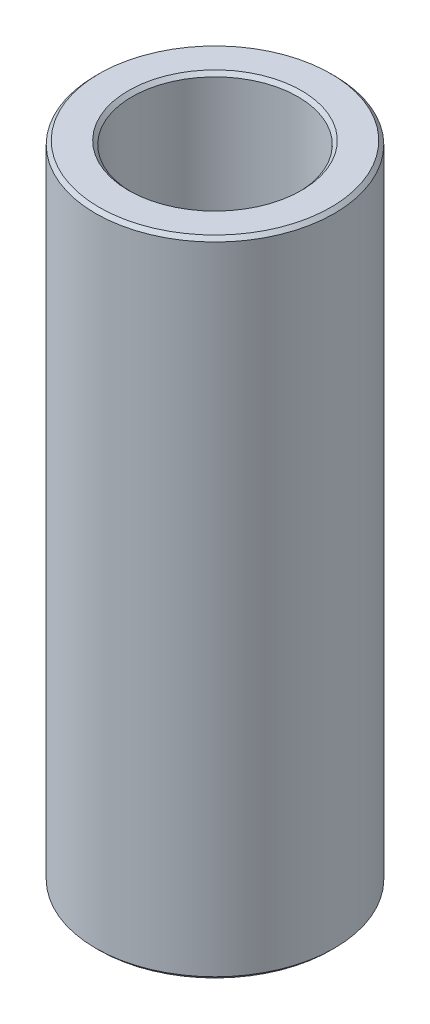
ISO-10303-21;
HEADER;
FILE_DESCRIPTION(('STEP AP214'),'2;1');
FILE_NAME('part.step','',(''),(''),'','','');
FILE_SCHEMA(('AUTOMOTIVE_DESIGN { 1 0 10303 214 1 1 1 1 }'));
ENDSEC;
DATA;
#1=APPLICATION_CONTEXT('core data for automotive mechanical design processes');
#2=APPLICATION_PROTOCOL_DEFINITION('international standard','automotive_design',2000,#1);
#3=PRODUCT_CONTEXT('',#1,'mechanical');
#4=PRODUCT('Part','Part','',(#3));
#5=PRODUCT_RELATED_PRODUCT_CATEGORY('part','',(#4));
#6=PRODUCT_DEFINITION_FORMATION('','',#4);
#7=PRODUCT_DEFINITION_CONTEXT('part definition',#1,'design');
#8=PRODUCT_DEFINITION('design','',#6,#7);
#9=PRODUCT_DEFINITION_SHAPE('','',#8);
#10=(LENGTH_UNIT() NAMED_UNIT(*) SI_UNIT(.MILLI.,.METRE.));
#11=(NAMED_UNIT(*) PLANE_ANGLE_UNIT() SI_UNIT($,.RADIAN.));
#12=(NAMED_UNIT(*) SI_UNIT($,.STERADIAN.) SOLID_ANGLE_UNIT());
#13=UNCERTAINTY_MEASURE_WITH_UNIT(LENGTH_MEASURE(1.E-05),#10,'distance_accuracy_value','');
#14=(GEOMETRIC_REPRESENTATION_CONTEXT(3) GLOBAL_UNCERTAINTY_ASSIGNED_CONTEXT((#13)) GLOBAL_UNIT_ASSIGNED_CONTEXT((#10,
#11,#12)) REPRESENTATION_CONTEXT('',''));
#15=CARTESIAN_POINT('',(0.,0.,0.));
#16=DIRECTION('',(0.,0.,1.));
#17=DIRECTION('',(1.,0.,0.));
#18=AXIS2_PLACEMENT_3D('',#15,#16,#17);
#19=CARTESIAN_POINT('',(0.,80.855053610554,0.));
#20=DIRECTION('',(0.,-1.,0.));
#21=DIRECTION('',(0.,0.,-1.));
#22=AXIS2_PLACEMENT_3D('',#19,#20,#21);
#23=CYLINDRICAL_SURFACE('',#22,15.);
#24=CARTESIAN_POINT('',(0.,0.445644070294085,0.));
#25=DIRECTION('',(0.,1.,0.));
#26=DIRECTION('',(0.,0.,1.));
#27=AXIS2_PLACEMENT_3D('',#24,#25,#26);
#28=CIRCLE('',#27,15.);
#29=CARTESIAN_POINT('',(0.,0.445644070294085,15.));
#30=VERTEX_POINT('',#29);
#31=EDGE_CURVE('E10',#30,#30,#28,.T.);
#32=ORIENTED_EDGE('',*,*,#31,.T.);
#33=EDGE_LOOP('',(#32));
#34=FACE_BOUND('',#33,.T.);
#35=CARTESIAN_POINT('',(0.,80.4094095402599,0.));
#36=DIRECTION('',(0.,1.,0.));
#37=DIRECTION('',(0.,0.,1.));
#38=AXIS2_PLACEMENT_3D('',#35,#36,#37);
#39=CIRCLE('',#38,15.);
#40=CARTESIAN_POINT('',(0.,80.4094095402599,15.));
#41=VERTEX_POINT('',#40);
#42=EDGE_CURVE('E50',#41,#41,#39,.F.);
#43=ORIENTED_EDGE('',*,*,#42,.T.);
#44=EDGE_LOOP('',(#43));
#45=FACE_BOUND('',#44,.T.);
#46=ADVANCED_FACE('F39',(#34,#45),#23,.T.);
#47=CARTESIAN_POINT('',(0.,80.855053610554,0.));
#48=DIRECTION('',(0.,1.,0.));
#49=DIRECTION('',(0.,0.,1.));
#50=AXIS2_PLACEMENT_3D('',#47,#48,#49);
#51=PLANE('',#50);
#52=CARTESIAN_POINT('',(0.,80.855053610554,0.));
#53=DIRECTION('',(0.,1.,0.));
#54=DIRECTION('',(0.,0.,1.));
#55=AXIS2_PLACEMENT_3D('',#52,#53,#54);
#56=CIRCLE('',#55,10.8718224224261);
#57=CARTESIAN_POINT('',(0.,80.855053610554,10.8718224224261));
#58=VERTEX_POINT('',#57);
#59=EDGE_CURVE('E58',#58,#58,#56,.F.);
#60=ORIENTED_EDGE('',*,*,#59,.T.);
#61=EDGE_LOOP('',(#60));
#62=FACE_BOUND('',#61,.T.);
#63=CARTESIAN_POINT('',(0.,80.855053610554,0.));
#64=DIRECTION('',(0.,1.,0.));
#65=DIRECTION('',(0.,0.,1.));
#66=AXIS2_PLACEMENT_3D('',#63,#64,#65);
#67=CIRCLE('',#66,14.5543559297059);
#68=CARTESIAN_POINT('',(0.,80.855053610554,14.5543559297059));
#69=VERTEX_POINT('',#68);
#70=EDGE_CURVE('E61',#69,#69,#67,.T.);
#71=ORIENTED_EDGE('',*,*,#70,.T.);
#72=EDGE_LOOP('',(#71));
#73=FACE_BOUND('',#72,.T.);
#74=ADVANCED_FACE('F88',(#62,#73),#51,.T.);
#75=CARTESIAN_POINT('',(0.,0.,0.));
#76=DIRECTION('',(0.,1.,0.));
#77=DIRECTION('',(0.,0.,1.));
#78=AXIS2_PLACEMENT_3D('',#75,#76,#77);
#79=PLANE('',#78);
#80=CARTESIAN_POINT('',(0.,0.,0.));
#81=DIRECTION('',(0.,1.,0.));
#82=DIRECTION('',(0.,0.,1.));
#83=AXIS2_PLACEMENT_3D('',#80,#81,#82);
#84=CIRCLE('',#83,10.8718224224261);
#85=CARTESIAN_POINT('',(0.,0.,10.8718224224261));
#86=VERTEX_POINT('',#85);
#87=EDGE_CURVE('E51',#86,#86,#84,.T.);
#88=ORIENTED_EDGE('',*,*,#87,.T.);
#89=EDGE_LOOP('',(#88));
#90=FACE_BOUND('',#89,.T.);
#91=CARTESIAN_POINT('',(0.,0.,0.));
#92=DIRECTION('',(0.,1.,0.));
#93=DIRECTION('',(0.,0.,1.));
#94=AXIS2_PLACEMENT_3D('',#91,#92,#93);
#95=CIRCLE('',#94,14.5543559297059);
#96=CARTESIAN_POINT('',(0.,0.,14.5543559297059));
#97=VERTEX_POINT('',#96);
#98=EDGE_CURVE('E54',#97,#97,#95,.F.);
#99=ORIENTED_EDGE('',*,*,#98,.T.);
#100=EDGE_LOOP('',(#99));
#101=FACE_BOUND('',#100,.T.);
#102=ADVANCED_FACE('F83',(#90,#101),#79,.F.);
#103=CARTESIAN_POINT('',(0.,80.855053610554,0.));
#104=DIRECTION('',(0.,-1.,0.));
#105=DIRECTION('',(0.,0.,-1.));
#106=AXIS2_PLACEMENT_3D('',#103,#104,#105);
#107=CYLINDRICAL_SURFACE('',#106,10.4261783521321);
#108=CARTESIAN_POINT('',(0.,80.4094095402599,0.));
#109=DIRECTION('',(0.,1.,0.));
#110=DIRECTION('',(0.,0.,1.));
#111=AXIS2_PLACEMENT_3D('',#108,#109,#110);
#112=CIRCLE('',#111,10.4261783521321);
#113=CARTESIAN_POINT('',(0.,80.4094095402599,10.4261783521321));
#114=VERTEX_POINT('',#113);
#115=EDGE_CURVE('E67',#114,#114,#112,.T.);
#116=ORIENTED_EDGE('',*,*,#115,.T.);
#117=EDGE_LOOP('',(#116));
#118=FACE_BOUND('',#117,.T.);
#119=CARTESIAN_POINT('',(0.,0.445644070294085,0.));
#120=DIRECTION('',(0.,1.,0.));
#121=DIRECTION('',(0.,0.,1.));
#122=AXIS2_PLACEMENT_3D('',#119,#120,#121);
#123=CIRCLE('',#122,10.4261783521321);
#124=CARTESIAN_POINT('',(0.,0.445644070294085,10.4261783521321));
#125=VERTEX_POINT('',#124);
#126=EDGE_CURVE('E69',#125,#125,#123,.F.);
#127=ORIENTED_EDGE('',*,*,#126,.T.);
#128=EDGE_LOOP('',(#127));
#129=FACE_BOUND('',#128,.T.);
#130=ADVANCED_FACE('F71',(#118,#129),#107,.F.);
#131=CARTESIAN_POINT('',(0.,80.4094095402599,0.));
#132=DIRECTION('',(0.,1.,0.));
#133=DIRECTION('',(0.,0.,1.));
#134=AXIS2_PLACEMENT_3D('',#131,#132,#133);
#135=CONICAL_SURFACE('',#134,10.4261783521321,0.785398163397448);
#136=ORIENTED_EDGE('',*,*,#59,.F.);
#137=EDGE_LOOP('',(#136));
#138=FACE_BOUND('',#137,.T.);
#139=ORIENTED_EDGE('',*,*,#115,.F.);
#140=EDGE_LOOP('',(#139));
#141=FACE_BOUND('',#140,.T.);
#142=ADVANCED_FACE('F77',(#138,#141),#135,.F.);
#143=CARTESIAN_POINT('',(0.,0.,0.));
#144=DIRECTION('',(0.,-1.,0.));
#145=DIRECTION('',(0.,0.,-1.));
#146=AXIS2_PLACEMENT_3D('',#143,#144,#145);
#147=CONICAL_SURFACE('',#146,10.8718224224261,0.785398163397433);
#148=ORIENTED_EDGE('',*,*,#126,.F.);
#149=EDGE_LOOP('',(#148));
#150=FACE_BOUND('',#149,.T.);
#151=ORIENTED_EDGE('',*,*,#87,.F.);
#152=EDGE_LOOP('',(#151));
#153=FACE_BOUND('',#152,.T.);
#154=ADVANCED_FACE('F73',(#150,#153),#147,.F.);
#155=CARTESIAN_POINT('',(0.,0.445644070294085,0.));
#156=DIRECTION('',(0.,1.,0.));
#157=DIRECTION('',(0.,0.,1.));
#158=AXIS2_PLACEMENT_3D('',#155,#156,#157);
#159=CONICAL_SURFACE('',#158,15.,0.785398163397456);
#160=ORIENTED_EDGE('',*,*,#98,.F.);
#161=EDGE_LOOP('',(#160));
#162=FACE_BOUND('',#161,.T.);
#163=ORIENTED_EDGE('',*,*,#31,.F.);
#164=EDGE_LOOP('',(#163));
#165=FACE_BOUND('',#164,.T.);
#166=ADVANCED_FACE('F76',(#162,#165),#159,.T.);
#167=CARTESIAN_POINT('',(0.,80.855053610554,0.));
#168=DIRECTION('',(0.,-1.,0.));
#169=DIRECTION('',(0.,0.,-1.));
#170=AXIS2_PLACEMENT_3D('',#167,#168,#169);
#171=CONICAL_SURFACE('',#170,14.5543559297059,0.785398163397448);
#172=ORIENTED_EDGE('',*,*,#42,.F.);
#173=EDGE_LOOP('',(#172));
#174=FACE_BOUND('',#173,.T.);
#175=ORIENTED_EDGE('',*,*,#70,.F.);
#176=EDGE_LOOP('',(#175));
#177=FACE_BOUND('',#176,.T.);
#178=ADVANCED_FACE('F45',(#174,#177),#171,.T.);
#179=CLOSED_SHELL('',(#46,#74,#102,#130,#142,#154,#166,#178));
#180=MANIFOLD_SOLID_BREP('B2',#179);
#181=ADVANCED_BREP_SHAPE_REPRESENTATION('',(#18,#180),#14);
#182=SHAPE_DEFINITION_REPRESENTATION(#9,#181);
ENDSEC;
END-ISO-10303-21;
